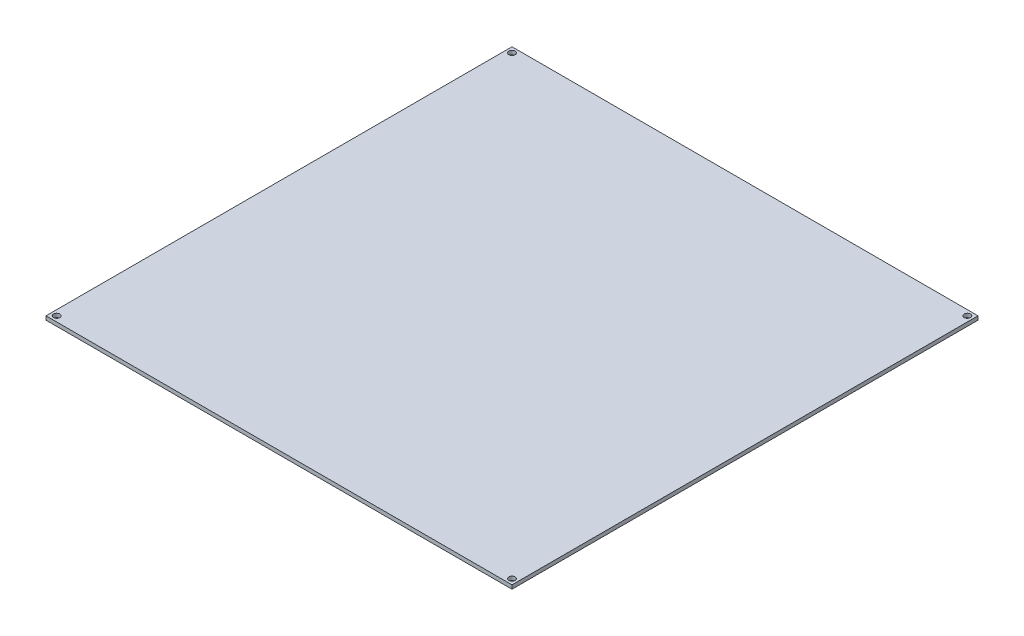
ISO-10303-21;
HEADER;
FILE_DESCRIPTION(('STEP AP214'),'2;1');
FILE_NAME('part.step','',(''),(''),'','','');
FILE_SCHEMA(('AUTOMOTIVE_DESIGN { 1 0 10303 214 1 1 1 1 }'));
ENDSEC;
DATA;
#1=APPLICATION_CONTEXT('core data for automotive mechanical design processes');
#2=APPLICATION_PROTOCOL_DEFINITION('international standard','automotive_design',2000,#1);
#3=PRODUCT_CONTEXT('',#1,'mechanical');
#4=PRODUCT('Part','Part','',(#3));
#5=PRODUCT_RELATED_PRODUCT_CATEGORY('part','',(#4));
#6=PRODUCT_DEFINITION_FORMATION('','',#4);
#7=PRODUCT_DEFINITION_CONTEXT('part definition',#1,'design');
#8=PRODUCT_DEFINITION('design','',#6,#7);
#9=PRODUCT_DEFINITION_SHAPE('','',#8);
#10=(LENGTH_UNIT() NAMED_UNIT(*) SI_UNIT(.MILLI.,.METRE.));
#11=(NAMED_UNIT(*) PLANE_ANGLE_UNIT() SI_UNIT($,.RADIAN.));
#12=(NAMED_UNIT(*) SI_UNIT($,.STERADIAN.) SOLID_ANGLE_UNIT());
#13=UNCERTAINTY_MEASURE_WITH_UNIT(LENGTH_MEASURE(1.E-05),#10,'distance_accuracy_value','');
#14=(GEOMETRIC_REPRESENTATION_CONTEXT(3) GLOBAL_UNCERTAINTY_ASSIGNED_CONTEXT((#13)) GLOBAL_UNIT_ASSIGNED_CONTEXT((#10,
#11,#12)) REPRESENTATION_CONTEXT('',''));
#15=CARTESIAN_POINT('',(0.,0.,0.));
#16=DIRECTION('',(0.,0.,1.));
#17=DIRECTION('',(1.,0.,0.));
#18=AXIS2_PLACEMENT_3D('',#15,#16,#17);
#19=CARTESIAN_POINT('',(-107.,1.75,107.));
#20=DIRECTION('',(0.,1.,0.));
#21=DIRECTION('',(0.,0.,1.));
#22=AXIS2_PLACEMENT_3D('',#19,#20,#21);
#23=PLANE('',#22);
#24=CARTESIAN_POINT('',(104.555,1.75,104.555));
#25=DIRECTION('',(0.,1.,0.));
#26=DIRECTION('',(0.,0.,1.));
#27=AXIS2_PLACEMENT_3D('',#24,#25,#26);
#28=CIRCLE('',#27,1.44500000000001);
#29=CARTESIAN_POINT('',(104.555,1.75,106.));
#30=VERTEX_POINT('',#29);
#31=EDGE_CURVE('E119',#30,#30,#28,.T.);
#32=ORIENTED_EDGE('',*,*,#31,.F.);
#33=EDGE_LOOP('',(#32));
#34=FACE_BOUND('',#33,.T.);
#35=CARTESIAN_POINT('',(-104.555,1.75,-104.555));
#36=DIRECTION('',(0.,1.,0.));
#37=DIRECTION('',(0.,0.,1.));
#38=AXIS2_PLACEMENT_3D('',#35,#36,#37);
#39=CIRCLE('',#38,1.44500000000001);
#40=CARTESIAN_POINT('',(-104.555,1.75,-103.11));
#41=VERTEX_POINT('',#40);
#42=EDGE_CURVE('E98',#41,#41,#39,.T.);
#43=ORIENTED_EDGE('',*,*,#42,.F.);
#44=EDGE_LOOP('',(#43));
#45=FACE_BOUND('',#44,.T.);
#46=DIRECTION('',(0.,0.,1.));
#47=VECTOR('',#46,1.);
#48=CARTESIAN_POINT('',(-107.,1.75,-107.));
#49=LINE('',#48,#47);
#50=CARTESIAN_POINT('',(-107.,1.75,-107.));
#51=VERTEX_POINT('',#50);
#52=CARTESIAN_POINT('',(-107.,1.75,107.));
#53=VERTEX_POINT('',#52);
#54=EDGE_CURVE('E83',#51,#53,#49,.T.);
#55=ORIENTED_EDGE('',*,*,#54,.T.);
#56=DIRECTION('',(1.,0.,0.));
#57=VECTOR('',#56,1.);
#58=CARTESIAN_POINT('',(-107.,1.75,107.));
#59=LINE('',#58,#57);
#60=CARTESIAN_POINT('',(107.,1.75,107.));
#61=VERTEX_POINT('',#60);
#62=EDGE_CURVE('E78',#53,#61,#59,.T.);
#63=ORIENTED_EDGE('',*,*,#62,.T.);
#64=DIRECTION('',(0.,0.,-1.));
#65=VECTOR('',#64,1.);
#66=CARTESIAN_POINT('',(107.,1.75,-107.));
#67=LINE('',#66,#65);
#68=CARTESIAN_POINT('',(107.,1.75,-107.));
#69=VERTEX_POINT('',#68);
#70=EDGE_CURVE('E81',#61,#69,#67,.T.);
#71=ORIENTED_EDGE('',*,*,#70,.T.);
#72=DIRECTION('',(-1.,0.,0.));
#73=VECTOR('',#72,1.);
#74=CARTESIAN_POINT('',(-107.,1.75,-107.));
#75=LINE('',#74,#73);
#76=EDGE_CURVE('E48',#69,#51,#75,.T.);
#77=ORIENTED_EDGE('',*,*,#76,.T.);
#78=EDGE_LOOP('',(#55,#63,#71,#77));
#79=FACE_BOUND('',#78,.T.);
#80=CARTESIAN_POINT('',(104.555,1.75,-104.555));
#81=DIRECTION('',(0.,1.,0.));
#82=DIRECTION('',(0.,0.,1.));
#83=AXIS2_PLACEMENT_3D('',#80,#81,#82);
#84=CIRCLE('',#83,1.44500000000001);
#85=CARTESIAN_POINT('',(104.555,1.75,-103.11));
#86=VERTEX_POINT('',#85);
#87=EDGE_CURVE('E113',#86,#86,#84,.T.);
#88=ORIENTED_EDGE('',*,*,#87,.F.);
#89=EDGE_LOOP('',(#88));
#90=FACE_BOUND('',#89,.T.);
#91=CARTESIAN_POINT('',(-104.555,1.75,104.555));
#92=DIRECTION('',(0.,1.,0.));
#93=DIRECTION('',(0.,0.,1.));
#94=AXIS2_PLACEMENT_3D('',#91,#92,#93);
#95=CIRCLE('',#94,1.44500000000001);
#96=CARTESIAN_POINT('',(-104.555,1.75,106.));
#97=VERTEX_POINT('',#96);
#98=EDGE_CURVE('E125',#97,#97,#95,.T.);
#99=ORIENTED_EDGE('',*,*,#98,.F.);
#100=EDGE_LOOP('',(#99));
#101=FACE_BOUND('',#100,.T.);
#102=ADVANCED_FACE('F31',(#34,#45,#79,#90,#101),#23,.T.);
#103=CARTESIAN_POINT('',(-107.,0.,107.));
#104=DIRECTION('',(0.,1.,0.));
#105=DIRECTION('',(0.,0.,1.));
#106=AXIS2_PLACEMENT_3D('',#103,#104,#105);
#107=PLANE('',#106);
#108=CARTESIAN_POINT('',(104.555,0.,104.555));
#109=DIRECTION('',(0.,1.,0.));
#110=DIRECTION('',(0.,0.,1.));
#111=AXIS2_PLACEMENT_3D('',#108,#109,#110);
#112=CIRCLE('',#111,1.44500000000001);
#113=CARTESIAN_POINT('',(104.555,0.,106.));
#114=VERTEX_POINT('',#113);
#115=EDGE_CURVE('E122',#114,#114,#112,.T.);
#116=ORIENTED_EDGE('',*,*,#115,.T.);
#117=EDGE_LOOP('',(#116));
#118=FACE_BOUND('',#117,.T.);
#119=CARTESIAN_POINT('',(-104.555,0.,-104.555));
#120=DIRECTION('',(0.,1.,0.));
#121=DIRECTION('',(0.,0.,1.));
#122=AXIS2_PLACEMENT_3D('',#119,#120,#121);
#123=CIRCLE('',#122,1.44500000000001);
#124=CARTESIAN_POINT('',(-104.555,0.,-103.11));
#125=VERTEX_POINT('',#124);
#126=EDGE_CURVE('E110',#125,#125,#123,.T.);
#127=ORIENTED_EDGE('',*,*,#126,.T.);
#128=EDGE_LOOP('',(#127));
#129=FACE_BOUND('',#128,.T.);
#130=DIRECTION('',(0.,0.,1.));
#131=VECTOR('',#130,1.);
#132=CARTESIAN_POINT('',(-107.,0.,-107.));
#133=LINE('',#132,#131);
#134=CARTESIAN_POINT('',(-107.,0.,-107.));
#135=VERTEX_POINT('',#134);
#136=CARTESIAN_POINT('',(-107.,0.,107.));
#137=VERTEX_POINT('',#136);
#138=EDGE_CURVE('E95',#135,#137,#133,.T.);
#139=ORIENTED_EDGE('',*,*,#138,.F.);
#140=DIRECTION('',(-1.,0.,0.));
#141=VECTOR('',#140,1.);
#142=CARTESIAN_POINT('',(-107.,0.,-107.));
#143=LINE('',#142,#141);
#144=CARTESIAN_POINT('',(107.,0.,-107.));
#145=VERTEX_POINT('',#144);
#146=EDGE_CURVE('E71',#145,#135,#143,.T.);
#147=ORIENTED_EDGE('',*,*,#146,.F.);
#148=DIRECTION('',(0.,0.,-1.));
#149=VECTOR('',#148,1.);
#150=CARTESIAN_POINT('',(107.,0.,-107.));
#151=LINE('',#150,#149);
#152=CARTESIAN_POINT('',(107.,0.,107.));
#153=VERTEX_POINT('',#152);
#154=EDGE_CURVE('E65',#153,#145,#151,.T.);
#155=ORIENTED_EDGE('',*,*,#154,.F.);
#156=DIRECTION('',(1.,0.,0.));
#157=VECTOR('',#156,1.);
#158=CARTESIAN_POINT('',(-107.,0.,107.));
#159=LINE('',#158,#157);
#160=EDGE_CURVE('E87',#137,#153,#159,.T.);
#161=ORIENTED_EDGE('',*,*,#160,.F.);
#162=EDGE_LOOP('',(#139,#147,#155,#161));
#163=FACE_BOUND('',#162,.T.);
#164=CARTESIAN_POINT('',(104.555,0.,-104.555));
#165=DIRECTION('',(0.,1.,0.));
#166=DIRECTION('',(0.,0.,1.));
#167=AXIS2_PLACEMENT_3D('',#164,#165,#166);
#168=CIRCLE('',#167,1.44500000000001);
#169=CARTESIAN_POINT('',(104.555,0.,-103.11));
#170=VERTEX_POINT('',#169);
#171=EDGE_CURVE('E116',#170,#170,#168,.T.);
#172=ORIENTED_EDGE('',*,*,#171,.T.);
#173=EDGE_LOOP('',(#172));
#174=FACE_BOUND('',#173,.T.);
#175=CARTESIAN_POINT('',(-104.555,0.,104.555));
#176=DIRECTION('',(0.,1.,0.));
#177=DIRECTION('',(0.,0.,1.));
#178=AXIS2_PLACEMENT_3D('',#175,#176,#177);
#179=CIRCLE('',#178,1.44500000000001);
#180=CARTESIAN_POINT('',(-104.555,0.,106.));
#181=VERTEX_POINT('',#180);
#182=EDGE_CURVE('E128',#181,#181,#179,.T.);
#183=ORIENTED_EDGE('',*,*,#182,.T.);
#184=EDGE_LOOP('',(#183));
#185=FACE_BOUND('',#184,.T.);
#186=ADVANCED_FACE('F106',(#118,#129,#163,#174,#185),#107,.F.);
#187=CARTESIAN_POINT('',(-107.,1.75,-107.));
#188=DIRECTION('',(1.,0.,0.));
#189=DIRECTION('',(0.,0.,-1.));
#190=AXIS2_PLACEMENT_3D('',#187,#188,#189);
#191=PLANE('',#190);
#192=ORIENTED_EDGE('',*,*,#138,.T.);
#193=DIRECTION('',(0.,-1.,0.));
#194=VECTOR('',#193,1.);
#195=CARTESIAN_POINT('',(-107.,1.75,107.));
#196=LINE('',#195,#194);
#197=EDGE_CURVE('E11',#53,#137,#196,.T.);
#198=ORIENTED_EDGE('',*,*,#197,.F.);
#199=ORIENTED_EDGE('',*,*,#54,.F.);
#200=DIRECTION('',(0.,-1.,0.));
#201=VECTOR('',#200,1.);
#202=CARTESIAN_POINT('',(-107.,1.75,-107.));
#203=LINE('',#202,#201);
#204=EDGE_CURVE('E91',#51,#135,#203,.T.);
#205=ORIENTED_EDGE('',*,*,#204,.T.);
#206=EDGE_LOOP('',(#192,#198,#199,#205));
#207=FACE_BOUND('',#206,.T.);
#208=ADVANCED_FACE('F33',(#207),#191,.F.);
#209=CARTESIAN_POINT('',(-107.,1.75,107.));
#210=DIRECTION('',(0.,0.,-1.));
#211=DIRECTION('',(-1.,0.,0.));
#212=AXIS2_PLACEMENT_3D('',#209,#210,#211);
#213=PLANE('',#212);
#214=ORIENTED_EDGE('',*,*,#160,.T.);
#215=DIRECTION('',(0.,-1.,0.));
#216=VECTOR('',#215,1.);
#217=CARTESIAN_POINT('',(107.,1.75,107.));
#218=LINE('',#217,#216);
#219=EDGE_CURVE('E40',#61,#153,#218,.T.);
#220=ORIENTED_EDGE('',*,*,#219,.F.);
#221=ORIENTED_EDGE('',*,*,#62,.F.);
#222=ORIENTED_EDGE('',*,*,#197,.T.);
#223=EDGE_LOOP('',(#214,#220,#221,#222));
#224=FACE_BOUND('',#223,.T.);
#225=ADVANCED_FACE('F86',(#224),#213,.F.);
#226=CARTESIAN_POINT('',(107.,1.75,-107.));
#227=DIRECTION('',(-1.,0.,0.));
#228=DIRECTION('',(0.,0.,1.));
#229=AXIS2_PLACEMENT_3D('',#226,#227,#228);
#230=PLANE('',#229);
#231=ORIENTED_EDGE('',*,*,#154,.T.);
#232=DIRECTION('',(0.,-1.,0.));
#233=VECTOR('',#232,1.);
#234=CARTESIAN_POINT('',(107.,1.75,-107.));
#235=LINE('',#234,#233);
#236=EDGE_CURVE('E88',#69,#145,#235,.T.);
#237=ORIENTED_EDGE('',*,*,#236,.F.);
#238=ORIENTED_EDGE('',*,*,#70,.F.);
#239=ORIENTED_EDGE('',*,*,#219,.T.);
#240=EDGE_LOOP('',(#231,#237,#238,#239));
#241=FACE_BOUND('',#240,.T.);
#242=ADVANCED_FACE('F89',(#241),#230,.F.);
#243=CARTESIAN_POINT('',(-107.,1.75,-107.));
#244=DIRECTION('',(0.,0.,1.));
#245=DIRECTION('',(1.,0.,0.));
#246=AXIS2_PLACEMENT_3D('',#243,#244,#245);
#247=PLANE('',#246);
#248=ORIENTED_EDGE('',*,*,#146,.T.);
#249=ORIENTED_EDGE('',*,*,#204,.F.);
#250=ORIENTED_EDGE('',*,*,#76,.F.);
#251=ORIENTED_EDGE('',*,*,#236,.T.);
#252=EDGE_LOOP('',(#248,#249,#250,#251));
#253=FACE_BOUND('',#252,.T.);
#254=ADVANCED_FACE('F103',(#253),#247,.F.);
#255=CARTESIAN_POINT('',(-104.555,1.75,-104.555));
#256=DIRECTION('',(0.,-1.,0.));
#257=DIRECTION('',(0.,0.,-1.));
#258=AXIS2_PLACEMENT_3D('',#255,#256,#257);
#259=CYLINDRICAL_SURFACE('',#258,1.44500000000001);
#260=ORIENTED_EDGE('',*,*,#42,.T.);
#261=EDGE_LOOP('',(#260));
#262=FACE_BOUND('',#261,.T.);
#263=ORIENTED_EDGE('',*,*,#126,.F.);
#264=EDGE_LOOP('',(#263));
#265=FACE_BOUND('',#264,.T.);
#266=ADVANCED_FACE('F148',(#262,#265),#259,.F.);
#267=CARTESIAN_POINT('',(104.555,1.75,-104.555));
#268=DIRECTION('',(0.,-1.,0.));
#269=DIRECTION('',(0.,0.,-1.));
#270=AXIS2_PLACEMENT_3D('',#267,#268,#269);
#271=CYLINDRICAL_SURFACE('',#270,1.44500000000001);
#272=ORIENTED_EDGE('',*,*,#87,.T.);
#273=EDGE_LOOP('',(#272));
#274=FACE_BOUND('',#273,.T.);
#275=ORIENTED_EDGE('',*,*,#171,.F.);
#276=EDGE_LOOP('',(#275));
#277=FACE_BOUND('',#276,.T.);
#278=ADVANCED_FACE('F194',(#274,#277),#271,.F.);
#279=CARTESIAN_POINT('',(104.555,1.75,104.555));
#280=DIRECTION('',(0.,-1.,0.));
#281=DIRECTION('',(0.,0.,-1.));
#282=AXIS2_PLACEMENT_3D('',#279,#280,#281);
#283=CYLINDRICAL_SURFACE('',#282,1.44500000000001);
#284=ORIENTED_EDGE('',*,*,#31,.T.);
#285=EDGE_LOOP('',(#284));
#286=FACE_BOUND('',#285,.T.);
#287=ORIENTED_EDGE('',*,*,#115,.F.);
#288=EDGE_LOOP('',(#287));
#289=FACE_BOUND('',#288,.T.);
#290=ADVANCED_FACE('F202',(#286,#289),#283,.F.);
#291=CARTESIAN_POINT('',(-104.555,1.75,104.555));
#292=DIRECTION('',(0.,-1.,0.));
#293=DIRECTION('',(0.,0.,-1.));
#294=AXIS2_PLACEMENT_3D('',#291,#292,#293);
#295=CYLINDRICAL_SURFACE('',#294,1.44500000000001);
#296=ORIENTED_EDGE('',*,*,#98,.T.);
#297=EDGE_LOOP('',(#296));
#298=FACE_BOUND('',#297,.T.);
#299=ORIENTED_EDGE('',*,*,#182,.F.);
#300=EDGE_LOOP('',(#299));
#301=FACE_BOUND('',#300,.T.);
#302=ADVANCED_FACE('F134',(#298,#301),#295,.F.);
#303=CLOSED_SHELL('',(#102,#186,#208,#225,#242,#254,#266,#278,#290,#302));
#304=MANIFOLD_SOLID_BREP('B2',#303);
#305=ADVANCED_BREP_SHAPE_REPRESENTATION('',(#18,#304),#14);
#306=SHAPE_DEFINITION_REPRESENTATION(#9,#305);
ENDSEC;
END-ISO-10303-21;
